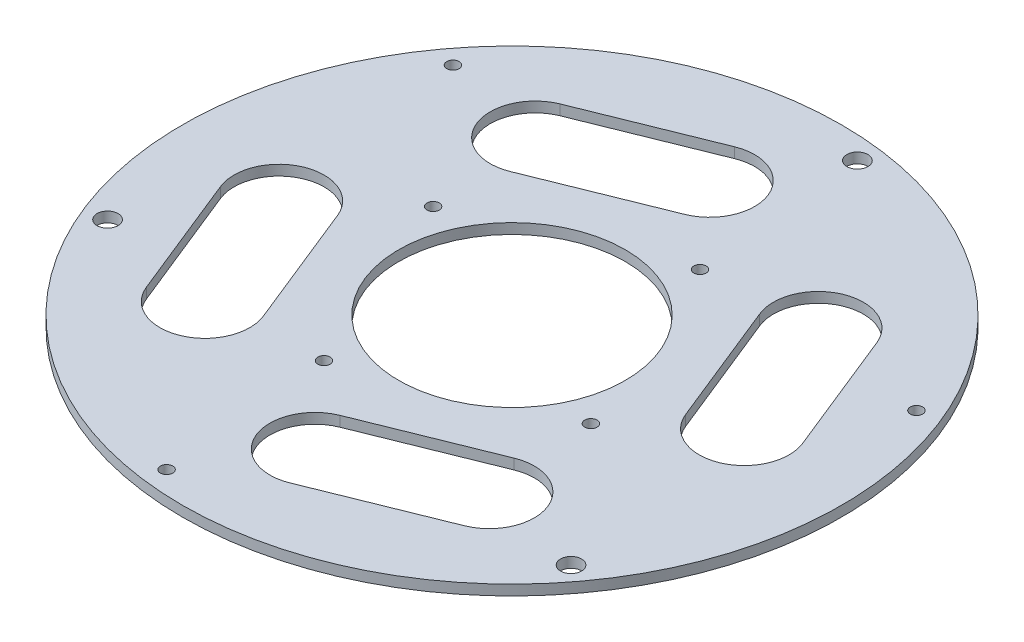
ISO-10303-21;
HEADER;
FILE_DESCRIPTION(('STEP AP214'),'2;1');
FILE_NAME('part.step','',(''),(''),'','','');
FILE_SCHEMA(('AUTOMOTIVE_DESIGN { 1 0 10303 214 1 1 1 1 }'));
ENDSEC;
DATA;
#1=APPLICATION_CONTEXT('core data for automotive mechanical design processes');
#2=APPLICATION_PROTOCOL_DEFINITION('international standard','automotive_design',2000,#1);
#3=PRODUCT_CONTEXT('',#1,'mechanical');
#4=PRODUCT('Part','Part','',(#3));
#5=PRODUCT_RELATED_PRODUCT_CATEGORY('part','',(#4));
#6=PRODUCT_DEFINITION_FORMATION('','',#4);
#7=PRODUCT_DEFINITION_CONTEXT('part definition',#1,'design');
#8=PRODUCT_DEFINITION('design','',#6,#7);
#9=PRODUCT_DEFINITION_SHAPE('','',#8);
#10=(LENGTH_UNIT() NAMED_UNIT(*) SI_UNIT(.MILLI.,.METRE.));
#11=(NAMED_UNIT(*) PLANE_ANGLE_UNIT() SI_UNIT($,.RADIAN.));
#12=(NAMED_UNIT(*) SI_UNIT($,.STERADIAN.) SOLID_ANGLE_UNIT());
#13=UNCERTAINTY_MEASURE_WITH_UNIT(LENGTH_MEASURE(1.E-05),#10,'distance_accuracy_value','');
#14=(GEOMETRIC_REPRESENTATION_CONTEXT(3) GLOBAL_UNCERTAINTY_ASSIGNED_CONTEXT((#13)) GLOBAL_UNIT_ASSIGNED_CONTEXT((#10,
#11,#12)) REPRESENTATION_CONTEXT('',''));
#15=CARTESIAN_POINT('',(0.,0.,0.));
#16=DIRECTION('',(0.,0.,1.));
#17=DIRECTION('',(1.,0.,0.));
#18=AXIS2_PLACEMENT_3D('',#15,#16,#17);
#19=CARTESIAN_POINT('',(0.,3.,0.));
#20=DIRECTION('',(0.,1.,0.));
#21=DIRECTION('',(0.,0.,1.));
#22=AXIS2_PLACEMENT_3D('',#19,#20,#21);
#23=PLANE('',#22);
#24=CARTESIAN_POINT('',(0.,3.,0.));
#25=DIRECTION('',(0.,-1.,0.));
#26=DIRECTION('',(0.,0.,-1.));
#27=AXIS2_PLACEMENT_3D('',#24,#25,#26);
#28=CIRCLE('',#27,55.);
#29=CARTESIAN_POINT('',(0.,3.,-55.));
#30=VERTEX_POINT('',#29);
#31=EDGE_CURVE('E197',#30,#30,#28,.T.);
#32=ORIENTED_EDGE('',*,*,#31,.F.);
#33=EDGE_LOOP('',(#32));
#34=FACE_BOUND('',#33,.T.);
#35=CARTESIAN_POINT('',(-26.488184691113,3.,64.7948768944698));
#36=DIRECTION('',(0.,1.,0.));
#37=DIRECTION('',(0.,0.,1.));
#38=AXIS2_PLACEMENT_3D('',#35,#36,#37);
#39=CIRCLE('',#38,3.);
#40=CARTESIAN_POINT('',(-26.488184691113,3.,67.7948768944698));
#41=VERTEX_POINT('',#40);
#42=EDGE_CURVE('E332',#41,#41,#39,.T.);
#43=ORIENTED_EDGE('',*,*,#42,.T.);
#44=EDGE_LOOP('',(#43));
#45=FACE_BOUND('',#44,.T.);
#46=CARTESIAN_POINT('',(64.7948768944695,3.,26.4881846911137));
#47=DIRECTION('',(0.,1.,0.));
#48=DIRECTION('',(0.,0.,1.));
#49=AXIS2_PLACEMENT_3D('',#46,#47,#48);
#50=CIRCLE('',#49,3.00000000000001);
#51=CARTESIAN_POINT('',(64.7948768944695,3.,29.4881846911137));
#52=VERTEX_POINT('',#51);
#53=EDGE_CURVE('E337',#52,#52,#50,.T.);
#54=ORIENTED_EDGE('',*,*,#53,.T.);
#55=EDGE_LOOP('',(#54));
#56=FACE_BOUND('',#55,.T.);
#57=CARTESIAN_POINT('',(26.4881846911135,3.,-64.7948768944696));
#58=DIRECTION('',(0.,1.,0.));
#59=DIRECTION('',(0.,0.,1.));
#60=AXIS2_PLACEMENT_3D('',#57,#58,#59);
#61=CIRCLE('',#60,3.);
#62=CARTESIAN_POINT('',(26.4881846911135,3.,-61.7948768944696));
#63=VERTEX_POINT('',#62);
#64=EDGE_CURVE('E340',#63,#63,#61,.T.);
#65=ORIENTED_EDGE('',*,*,#64,.T.);
#66=EDGE_LOOP('',(#65));
#67=FACE_BOUND('',#66,.T.);
#68=CARTESIAN_POINT('',(-64.7948768944695,3.,-26.4881846911137));
#69=DIRECTION('',(0.,1.,0.));
#70=DIRECTION('',(0.,0.,1.));
#71=AXIS2_PLACEMENT_3D('',#68,#69,#70);
#72=CIRCLE('',#71,3.);
#73=CARTESIAN_POINT('',(-64.7948768944695,3.,-23.4881846911137));
#74=VERTEX_POINT('',#73);
#75=EDGE_CURVE('E343',#74,#74,#72,.T.);
#76=ORIENTED_EDGE('',*,*,#75,.T.);
#77=EDGE_LOOP('',(#76));
#78=FACE_BOUND('',#77,.T.);
#79=CARTESIAN_POINT('',(18.8878454151755,3.,-148.806079498025));
#80=DIRECTION('',(0.,1.,0.));
#81=DIRECTION('',(0.,0.,1.));
#82=AXIS2_PLACEMENT_3D('',#79,#80,#81);
#83=CIRCLE('',#82,5.0999999999981);
#84=CARTESIAN_POINT('',(18.8878454151755,3.,-143.706079498027));
#85=VERTEX_POINT('',#84);
#86=EDGE_CURVE('E323',#85,#85,#83,.T.);
#87=ORIENTED_EDGE('',*,*,#86,.T.);
#88=EDGE_LOOP('',(#87));
#89=FACE_BOUND('',#88,.T.);
#90=CARTESIAN_POINT('',(-138.313767790444,3.,58.0456857967175));
#91=DIRECTION('',(0.,1.,0.));
#92=DIRECTION('',(0.,0.,1.));
#93=AXIS2_PLACEMENT_3D('',#90,#91,#92);
#94=CIRCLE('',#93,5.09999999999998);
#95=CARTESIAN_POINT('',(-138.313767790444,3.,63.1456857967175));
#96=VERTEX_POINT('',#95);
#97=EDGE_CURVE('E313',#96,#96,#94,.T.);
#98=ORIENTED_EDGE('',*,*,#97,.T.);
#99=EDGE_LOOP('',(#98));
#100=FACE_BOUND('',#99,.T.);
#101=CARTESIAN_POINT('',(119.425922375269,3.,90.7603937013074));
#102=DIRECTION('',(0.,1.,0.));
#103=DIRECTION('',(0.,0.,1.));
#104=AXIS2_PLACEMENT_3D('',#101,#102,#103);
#105=CIRCLE('',#104,5.09999999999913);
#106=CARTESIAN_POINT('',(119.425922375269,3.,95.8603937013066));
#107=VERTEX_POINT('',#106);
#108=EDGE_CURVE('E324',#107,#107,#105,.T.);
#109=ORIENTED_EDGE('',*,*,#108,.T.);
#110=EDGE_LOOP('',(#109));
#111=FACE_BOUND('',#110,.T.);
#112=CARTESIAN_POINT('',(68.8555329050066,3.,79.8792953417758));
#113=DIRECTION('',(0.,-1.,0.));
#114=DIRECTION('',(0.,0.,-1.));
#115=AXIS2_PLACEMENT_3D('',#112,#113,#114);
#116=CIRCLE('',#115,21.8428449653127);
#117=CARTESIAN_POINT('',(60.6285698170761,3.,59.6449939076142));
#118=VERTEX_POINT('',#117);
#119=CARTESIAN_POINT('',(77.0824959928751,3.,100.113596775963));
#120=VERTEX_POINT('',#119);
#121=EDGE_CURVE('E289',#118,#120,#116,.T.);
#122=ORIENTED_EDGE('',*,*,#121,.F.);
#123=DIRECTION('',(-0.927447708925459,0.,0.37395286763029));
#124=VECTOR('',#123,1.);
#125=CARTESIAN_POINT('',(29.1645244979781,3.,72.3314988836826));
#126=LINE('',#125,#124);
#127=CARTESIAN_POINT('',(0.344468737056292,3.,83.9519303035286));
#128=VERTEX_POINT('',#127);
#129=EDGE_CURVE('E239',#118,#128,#126,.T.);
#130=ORIENTED_EDGE('',*,*,#129,.T.);
#131=CARTESIAN_POINT('',(8.51262883790616,3.,104.209941479417));
#132=DIRECTION('',(0.,-1.,0.));
#133=DIRECTION('',(0.,0.,-1.));
#134=AXIS2_PLACEMENT_3D('',#131,#132,#133);
#135=CIRCLE('',#134,21.8427529454406);
#136=CARTESIAN_POINT('',(16.6807889387561,3.,124.467952655306));
#137=VERTEX_POINT('',#136);
#138=EDGE_CURVE('E277',#137,#128,#135,.T.);
#139=ORIENTED_EDGE('',*,*,#138,.F.);
#140=DIRECTION('',(-0.927447708925459,0.,0.37395286763029));
#141=VECTOR('',#140,1.);
#142=CARTESIAN_POINT('',(45.5008446997531,3.,112.84752123543));
#143=LINE('',#142,#141);
#144=EDGE_CURVE('E68',#120,#137,#143,.T.);
#145=ORIENTED_EDGE('',*,*,#144,.F.);
#146=EDGE_LOOP('',(#122,#130,#139,#145));
#147=FACE_BOUND('',#146,.T.);
#148=CARTESIAN_POINT('',(-104.525328062089,3.,8.57143182485349));
#149=DIRECTION('',(0.,-1.,0.));
#150=DIRECTION('',(0.,0.,-1.));
#151=AXIS2_PLACEMENT_3D('',#148,#149,#150);
#152=CIRCLE('',#151,21.8428449653128);
#153=CARTESIAN_POINT('',(-124.759629496275,3.,16.7983949127222));
#154=VERTEX_POINT('',#153);
#155=CARTESIAN_POINT('',(-84.2910266279013,3.,0.344468736985785));
#156=VERTEX_POINT('',#155);
#157=EDGE_CURVE('E230',#154,#156,#152,.T.);
#158=ORIENTED_EDGE('',*,*,#157,.F.);
#159=DIRECTION('',(0.373952867630291,0.,0.927447708925459));
#160=VECTOR('',#159,1.);
#161=CARTESIAN_POINT('',(-113.139198076402,3.,45.6184506737109));
#162=LINE('',#161,#160);
#163=CARTESIAN_POINT('',(-100.452693100307,3.,77.082495992876));
#164=VERTEX_POINT('',#163);
#165=EDGE_CURVE('E227',#154,#164,#162,.T.);
#166=ORIENTED_EDGE('',*,*,#165,.T.);
#167=CARTESIAN_POINT('',(-80.1946819244336,3.,68.9143358919871));
#168=DIRECTION('',(0.,-1.,0.));
#169=DIRECTION('',(0.,0.,-1.));
#170=AXIS2_PLACEMENT_3D('',#167,#168,#169);
#171=CIRCLE('',#170,21.8427529454408);
#172=CARTESIAN_POINT('',(-59.9366707485602,3.,60.7461757910982));
#173=VERTEX_POINT('',#172);
#174=EDGE_CURVE('E217',#173,#164,#171,.T.);
#175=ORIENTED_EDGE('',*,*,#174,.F.);
#176=DIRECTION('',(0.373952867630292,0.,0.927447708925458));
#177=VECTOR('',#176,1.);
#178=CARTESIAN_POINT('',(-72.6231757246547,3.,29.2821304719358));
#179=LINE('',#178,#177);
#180=EDGE_CURVE('E76',#156,#173,#179,.T.);
#181=ORIENTED_EDGE('',*,*,#180,.F.);
#182=EDGE_LOOP('',(#158,#166,#175,#181));
#183=FACE_BOUND('',#182,.T.);
#184=CARTESIAN_POINT('',(0.,3.,0.));
#185=DIRECTION('',(0.,-1.,0.));
#186=DIRECTION('',(0.,0.,-1.));
#187=AXIS2_PLACEMENT_3D('',#184,#185,#186);
#188=CIRCLE('',#187,160.);
#189=CARTESIAN_POINT('',(0.,3.,-160.));
#190=VERTEX_POINT('',#189);
#191=EDGE_CURVE('E311',#190,#190,#188,.T.);
#192=ORIENTED_EDGE('',*,*,#191,.T.);
#193=EDGE_LOOP('',(#192));
#194=FACE_BOUND('',#193,.T.);
#195=CARTESIAN_POINT('',(79.8792953417759,3.,-68.8555329050062));
#196=DIRECTION('',(0.,-1.,0.));
#197=DIRECTION('',(0.,0.,-1.));
#198=AXIS2_PLACEMENT_3D('',#195,#196,#197);
#199=CIRCLE('',#198,21.8428449653128);
#200=CARTESIAN_POINT('',(59.6449939075881,3.,-60.6285698171398));
#201=VERTEX_POINT('',#200);
#202=CARTESIAN_POINT('',(100.113596775964,3.,-77.0824959928726));
#203=VERTEX_POINT('',#202);
#204=EDGE_CURVE('E260',#201,#203,#199,.T.);
#205=ORIENTED_EDGE('',*,*,#204,.F.);
#206=DIRECTION('',(0.373952867630291,0.,0.927447708925458));
#207=VECTOR('',#206,1.);
#208=CARTESIAN_POINT('',(72.3314988836823,3.,-29.1645244979781));
#209=LINE('',#208,#207);
#210=CARTESIAN_POINT('',(83.951930303557,3.,-0.344468736984967));
#211=VERTEX_POINT('',#210);
#212=EDGE_CURVE('E209',#201,#211,#209,.T.);
#213=ORIENTED_EDGE('',*,*,#212,.T.);
#214=CARTESIAN_POINT('',(104.209941479431,3.,-8.51262883787253));
#215=DIRECTION('',(0.,-1.,0.));
#216=DIRECTION('',(0.,0.,-1.));
#217=AXIS2_PLACEMENT_3D('',#214,#215,#216);
#218=CIRCLE('',#217,21.8427529454408);
#219=CARTESIAN_POINT('',(124.467952655305,3.,-16.6807889387601));
#220=VERTEX_POINT('',#219);
#221=EDGE_CURVE('E248',#220,#211,#218,.T.);
#222=ORIENTED_EDGE('',*,*,#221,.F.);
#223=DIRECTION('',(0.373952867630291,0.,0.927447708925458));
#224=VECTOR('',#223,1.);
#225=CARTESIAN_POINT('',(112.84752123543,3.,-45.5008446997532));
#226=LINE('',#225,#224);
#227=EDGE_CURVE('E263',#203,#220,#226,.T.);
#228=ORIENTED_EDGE('',*,*,#227,.F.);
#229=EDGE_LOOP('',(#205,#213,#222,#228));
#230=FACE_BOUND('',#229,.T.);
#231=DIRECTION('',(-0.927447708925459,0.,0.373952867630289));
#232=VECTOR('',#231,1.);
#233=CARTESIAN_POINT('',(-29.2821304719356,3.,-72.6231757246548));
#234=LINE('',#233,#232);
#235=CARTESIAN_POINT('',(-0.344468736986014,3.,-84.2910266279011));
#236=VERTEX_POINT('',#235);
#237=CARTESIAN_POINT('',(-60.7461757911009,3.,-59.9366707485593));
#238=VERTEX_POINT('',#237);
#239=EDGE_CURVE('E173',#236,#238,#234,.T.);
#240=ORIENTED_EDGE('',*,*,#239,.F.);
#241=CARTESIAN_POINT('',(-8.57143182485231,3.,-104.525328062089));
#242=DIRECTION('',(0.,-1.,0.));
#243=DIRECTION('',(0.,0.,-1.));
#244=AXIS2_PLACEMENT_3D('',#241,#242,#243);
#245=CIRCLE('',#244,21.8428449653127);
#246=CARTESIAN_POINT('',(-16.7983949127351,3.,-124.75962949627));
#247=VERTEX_POINT('',#246);
#248=EDGE_CURVE('E191',#247,#236,#245,.T.);
#249=ORIENTED_EDGE('',*,*,#248,.F.);
#250=DIRECTION('',(-0.927447708925459,0.,0.373952867630289));
#251=VECTOR('',#250,1.);
#252=CARTESIAN_POINT('',(-45.6184506737106,3.,-113.139198076402));
#253=LINE('',#252,#251);
#254=CARTESIAN_POINT('',(-77.0824959928838,3.,-100.452693100304));
#255=VERTEX_POINT('',#254);
#256=EDGE_CURVE('E194',#247,#255,#253,.T.);
#257=ORIENTED_EDGE('',*,*,#256,.T.);
#258=CARTESIAN_POINT('',(-68.9143358919913,3.,-80.194681924432));
#259=DIRECTION('',(0.,-1.,0.));
#260=DIRECTION('',(0.,0.,-1.));
#261=AXIS2_PLACEMENT_3D('',#258,#259,#260);
#262=CIRCLE('',#261,21.8427529454407);
#263=EDGE_CURVE('E203',#238,#255,#262,.T.);
#264=ORIENTED_EDGE('',*,*,#263,.F.);
#265=EDGE_LOOP('',(#240,#249,#257,#264));
#266=FACE_BOUND('',#265,.T.);
#267=CARTESIAN_POINT('',(-119.425922375269,3.,-90.7603937013075));
#268=DIRECTION('',(0.,1.,0.));
#269=DIRECTION('',(0.,0.,1.));
#270=AXIS2_PLACEMENT_3D('',#267,#268,#269);
#271=CIRCLE('',#270,3.00000000000001);
#272=CARTESIAN_POINT('',(-119.425922375269,3.,-87.7603937013075));
#273=VERTEX_POINT('',#272);
#274=EDGE_CURVE('E351',#273,#273,#271,.T.);
#275=ORIENTED_EDGE('',*,*,#274,.T.);
#276=EDGE_LOOP('',(#275));
#277=FACE_BOUND('',#276,.T.);
#278=CARTESIAN_POINT('',(138.313767790444,3.,-58.0456857967166));
#279=DIRECTION('',(0.,1.,0.));
#280=DIRECTION('',(0.,0.,1.));
#281=AXIS2_PLACEMENT_3D('',#278,#279,#280);
#282=CIRCLE('',#281,2.99999999999999);
#283=CARTESIAN_POINT('',(138.313767790444,3.,-55.0456857967166));
#284=VERTEX_POINT('',#283);
#285=EDGE_CURVE('E362',#284,#284,#282,.T.);
#286=ORIENTED_EDGE('',*,*,#285,.T.);
#287=EDGE_LOOP('',(#286));
#288=FACE_BOUND('',#287,.T.);
#289=CARTESIAN_POINT('',(-18.8878454151745,3.,148.806079498025));
#290=DIRECTION('',(0.,1.,0.));
#291=DIRECTION('',(0.,0.,1.));
#292=AXIS2_PLACEMENT_3D('',#289,#290,#291);
#293=CIRCLE('',#292,3.);
#294=CARTESIAN_POINT('',(-18.8878454151745,3.,151.806079498025));
#295=VERTEX_POINT('',#294);
#296=EDGE_CURVE('E368',#295,#295,#293,.T.);
#297=ORIENTED_EDGE('',*,*,#296,.T.);
#298=EDGE_LOOP('',(#297));
#299=FACE_BOUND('',#298,.T.);
#300=ADVANCED_FACE('F53',(#34,#45,#56,#67,#78,#89,#100,#111,#147,#183,#194,#230,#266,#277,#288,
#299),#23,.F.);
#301=CARTESIAN_POINT('',(0.,3.,0.));
#302=DIRECTION('',(0.,-1.,0.));
#303=DIRECTION('',(0.,0.,-1.));
#304=AXIS2_PLACEMENT_3D('',#301,#302,#303);
#305=CYLINDRICAL_SURFACE('',#304,160.);
#306=CARTESIAN_POINT('',(0.,8.,0.));
#307=DIRECTION('',(0.,1.,0.));
#308=DIRECTION('',(0.,0.,1.));
#309=AXIS2_PLACEMENT_3D('',#306,#307,#308);
#310=CIRCLE('',#309,160.);
#311=CARTESIAN_POINT('',(0.,8.,160.));
#312=VERTEX_POINT('',#311);
#313=EDGE_CURVE('E12',#312,#312,#310,.T.);
#314=ORIENTED_EDGE('',*,*,#313,.F.);
#315=EDGE_LOOP('',(#314));
#316=FACE_BOUND('',#315,.T.);
#317=ORIENTED_EDGE('',*,*,#191,.F.);
#318=EDGE_LOOP('',(#317));
#319=FACE_BOUND('',#318,.T.);
#320=ADVANCED_FACE('F55',(#316,#319),#305,.T.);
#321=CARTESIAN_POINT('',(0.,3.,0.));
#322=DIRECTION('',(0.,-1.,0.));
#323=DIRECTION('',(0.,0.,-1.));
#324=AXIS2_PLACEMENT_3D('',#321,#322,#323);
#325=CYLINDRICAL_SURFACE('',#324,55.);
#326=CARTESIAN_POINT('',(0.,8.,0.));
#327=DIRECTION('',(0.,-1.,0.));
#328=DIRECTION('',(0.,0.,-1.));
#329=AXIS2_PLACEMENT_3D('',#326,#327,#328);
#330=CIRCLE('',#329,55.);
#331=CARTESIAN_POINT('',(0.,8.,-55.));
#332=VERTEX_POINT('',#331);
#333=EDGE_CURVE('E61',#332,#332,#330,.T.);
#334=ORIENTED_EDGE('',*,*,#333,.F.);
#335=EDGE_LOOP('',(#334));
#336=FACE_BOUND('',#335,.T.);
#337=ORIENTED_EDGE('',*,*,#31,.T.);
#338=EDGE_LOOP('',(#337));
#339=FACE_BOUND('',#338,.T.);
#340=ADVANCED_FACE('F305',(#336,#339),#325,.F.);
#341=CARTESIAN_POINT('',(0.,8.,0.));
#342=DIRECTION('',(0.,1.,0.));
#343=DIRECTION('',(0.,0.,1.));
#344=AXIS2_PLACEMENT_3D('',#341,#342,#343);
#345=PLANE('',#344);
#346=CARTESIAN_POINT('',(-26.488184691113,8.,64.7948768944698));
#347=DIRECTION('',(0.,1.,0.));
#348=DIRECTION('',(0.,0.,1.));
#349=AXIS2_PLACEMENT_3D('',#346,#347,#348);
#350=CIRCLE('',#349,3.);
#351=CARTESIAN_POINT('',(-26.488184691113,8.,67.7948768944698));
#352=VERTEX_POINT('',#351);
#353=EDGE_CURVE('E346',#352,#352,#350,.T.);
#354=ORIENTED_EDGE('',*,*,#353,.F.);
#355=EDGE_LOOP('',(#354));
#356=FACE_BOUND('',#355,.T.);
#357=CARTESIAN_POINT('',(64.7948768944695,8.,26.4881846911137));
#358=DIRECTION('',(0.,1.,0.));
#359=DIRECTION('',(0.,0.,1.));
#360=AXIS2_PLACEMENT_3D('',#357,#358,#359);
#361=CIRCLE('',#360,3.00000000000001);
#362=CARTESIAN_POINT('',(64.7948768944695,8.,29.4881846911137));
#363=VERTEX_POINT('',#362);
#364=EDGE_CURVE('E354',#363,#363,#361,.T.);
#365=ORIENTED_EDGE('',*,*,#364,.F.);
#366=EDGE_LOOP('',(#365));
#367=FACE_BOUND('',#366,.T.);
#368=CARTESIAN_POINT('',(26.4881846911135,8.,-64.7948768944696));
#369=DIRECTION('',(0.,1.,0.));
#370=DIRECTION('',(0.,0.,1.));
#371=AXIS2_PLACEMENT_3D('',#368,#369,#370);
#372=CIRCLE('',#371,3.);
#373=CARTESIAN_POINT('',(26.4881846911135,8.,-61.7948768944696));
#374=VERTEX_POINT('',#373);
#375=EDGE_CURVE('E350',#374,#374,#372,.T.);
#376=ORIENTED_EDGE('',*,*,#375,.F.);
#377=EDGE_LOOP('',(#376));
#378=FACE_BOUND('',#377,.T.);
#379=CARTESIAN_POINT('',(-64.7948768944695,8.,-26.4881846911137));
#380=DIRECTION('',(0.,1.,0.));
#381=DIRECTION('',(0.,0.,1.));
#382=AXIS2_PLACEMENT_3D('',#379,#380,#381);
#383=CIRCLE('',#382,3.);
#384=CARTESIAN_POINT('',(-64.7948768944695,8.,-23.4881846911137));
#385=VERTEX_POINT('',#384);
#386=EDGE_CURVE('E347',#385,#385,#383,.T.);
#387=ORIENTED_EDGE('',*,*,#386,.F.);
#388=EDGE_LOOP('',(#387));
#389=FACE_BOUND('',#388,.T.);
#390=CARTESIAN_POINT('',(18.8878454151755,8.,-148.806079498025));
#391=DIRECTION('',(0.,1.,0.));
#392=DIRECTION('',(0.,0.,1.));
#393=AXIS2_PLACEMENT_3D('',#390,#391,#392);
#394=CIRCLE('',#393,5.0999999999981);
#395=CARTESIAN_POINT('',(18.8878454151755,8.,-143.706079498027));
#396=VERTEX_POINT('',#395);
#397=EDGE_CURVE('E320',#396,#396,#394,.T.);
#398=ORIENTED_EDGE('',*,*,#397,.F.);
#399=EDGE_LOOP('',(#398));
#400=FACE_BOUND('',#399,.T.);
#401=CARTESIAN_POINT('',(-138.313767790444,8.,58.0456857967175));
#402=DIRECTION('',(0.,1.,0.));
#403=DIRECTION('',(0.,0.,1.));
#404=AXIS2_PLACEMENT_3D('',#401,#402,#403);
#405=CIRCLE('',#404,5.09999999999998);
#406=CARTESIAN_POINT('',(-138.313767790444,8.,63.1456857967175));
#407=VERTEX_POINT('',#406);
#408=EDGE_CURVE('E317',#407,#407,#405,.T.);
#409=ORIENTED_EDGE('',*,*,#408,.F.);
#410=EDGE_LOOP('',(#409));
#411=FACE_BOUND('',#410,.T.);
#412=CARTESIAN_POINT('',(119.425922375269,8.,90.7603937013074));
#413=DIRECTION('',(0.,1.,0.));
#414=DIRECTION('',(0.,0.,1.));
#415=AXIS2_PLACEMENT_3D('',#412,#413,#414);
#416=CIRCLE('',#415,5.09999999999913);
#417=CARTESIAN_POINT('',(119.425922375269,8.,95.8603937013066));
#418=VERTEX_POINT('',#417);
#419=EDGE_CURVE('E329',#418,#418,#416,.T.);
#420=ORIENTED_EDGE('',*,*,#419,.F.);
#421=EDGE_LOOP('',(#420));
#422=FACE_BOUND('',#421,.T.);
#423=DIRECTION('',(-0.927447708925459,0.,0.373952867630289));
#424=VECTOR('',#423,1.);
#425=CARTESIAN_POINT('',(-29.2821304719356,8.,-72.6231757246548));
#426=LINE('',#425,#424);
#427=CARTESIAN_POINT('',(-0.344468736986014,8.,-84.2910266279011));
#428=VERTEX_POINT('',#427);
#429=CARTESIAN_POINT('',(-60.7461757911009,8.,-59.9366707485593));
#430=VERTEX_POINT('',#429);
#431=EDGE_CURVE('E170',#428,#430,#426,.T.);
#432=ORIENTED_EDGE('',*,*,#431,.T.);
#433=CARTESIAN_POINT('',(-68.9143358919913,8.,-80.194681924432));
#434=DIRECTION('',(0.,-1.,0.));
#435=DIRECTION('',(0.,0.,-1.));
#436=AXIS2_PLACEMENT_3D('',#433,#434,#435);
#437=CIRCLE('',#436,21.8427529454407);
#438=CARTESIAN_POINT('',(-77.0824959928838,8.,-100.452693100304));
#439=VERTEX_POINT('',#438);
#440=EDGE_CURVE('E181',#430,#439,#437,.T.);
#441=ORIENTED_EDGE('',*,*,#440,.T.);
#442=DIRECTION('',(-0.927447708925459,0.,0.373952867630289));
#443=VECTOR('',#442,1.);
#444=CARTESIAN_POINT('',(-45.6184506737106,8.,-113.139198076402));
#445=LINE('',#444,#443);
#446=CARTESIAN_POINT('',(-16.7983949127351,8.,-124.75962949627));
#447=VERTEX_POINT('',#446);
#448=EDGE_CURVE('E186',#447,#439,#445,.T.);
#449=ORIENTED_EDGE('',*,*,#448,.F.);
#450=CARTESIAN_POINT('',(-8.57143182485231,8.,-104.525328062089));
#451=DIRECTION('',(0.,-1.,0.));
#452=DIRECTION('',(0.,0.,-1.));
#453=AXIS2_PLACEMENT_3D('',#450,#451,#452);
#454=CIRCLE('',#453,21.8428449653127);
#455=EDGE_CURVE('E178',#447,#428,#454,.T.);
#456=ORIENTED_EDGE('',*,*,#455,.T.);
#457=EDGE_LOOP('',(#432,#441,#449,#456));
#458=FACE_BOUND('',#457,.T.);
#459=ORIENTED_EDGE('',*,*,#333,.T.);
#460=EDGE_LOOP('',(#459));
#461=FACE_BOUND('',#460,.T.);
#462=ORIENTED_EDGE('',*,*,#313,.T.);
#463=EDGE_LOOP('',(#462));
#464=FACE_BOUND('',#463,.T.);
#465=CARTESIAN_POINT('',(8.51262883790616,8.,104.209941479417));
#466=DIRECTION('',(0.,-1.,0.));
#467=DIRECTION('',(0.,0.,-1.));
#468=AXIS2_PLACEMENT_3D('',#465,#466,#467);
#469=CIRCLE('',#468,21.8427529454406);
#470=CARTESIAN_POINT('',(16.6807889387561,8.,124.467952655306));
#471=VERTEX_POINT('',#470);
#472=CARTESIAN_POINT('',(0.344468737056292,8.,83.9519303035286));
#473=VERTEX_POINT('',#472);
#474=EDGE_CURVE('E283',#471,#473,#469,.T.);
#475=ORIENTED_EDGE('',*,*,#474,.T.);
#476=DIRECTION('',(-0.927447708925459,0.,0.37395286763029));
#477=VECTOR('',#476,1.);
#478=CARTESIAN_POINT('',(29.1645244979781,8.,72.3314988836826));
#479=LINE('',#478,#477);
#480=CARTESIAN_POINT('',(60.6285698170761,8.,59.6449939076142));
#481=VERTEX_POINT('',#480);
#482=EDGE_CURVE('E274',#481,#473,#479,.T.);
#483=ORIENTED_EDGE('',*,*,#482,.F.);
#484=CARTESIAN_POINT('',(68.8555329050066,8.,79.8792953417758));
#485=DIRECTION('',(0.,-1.,0.));
#486=DIRECTION('',(0.,0.,-1.));
#487=AXIS2_PLACEMENT_3D('',#484,#485,#486);
#488=CIRCLE('',#487,21.8428449653127);
#489=CARTESIAN_POINT('',(77.0824959928751,8.,100.113596775963));
#490=VERTEX_POINT('',#489);
#491=EDGE_CURVE('E276',#481,#490,#488,.T.);
#492=ORIENTED_EDGE('',*,*,#491,.T.);
#493=DIRECTION('',(-0.927447708925459,0.,0.37395286763029));
#494=VECTOR('',#493,1.);
#495=CARTESIAN_POINT('',(45.5008446997531,8.,112.84752123543));
#496=LINE('',#495,#494);
#497=EDGE_CURVE('E280',#490,#471,#496,.T.);
#498=ORIENTED_EDGE('',*,*,#497,.T.);
#499=EDGE_LOOP('',(#475,#483,#492,#498));
#500=FACE_BOUND('',#499,.T.);
#501=CARTESIAN_POINT('',(104.209941479431,8.,-8.51262883787253));
#502=DIRECTION('',(0.,-1.,0.));
#503=DIRECTION('',(0.,0.,-1.));
#504=AXIS2_PLACEMENT_3D('',#501,#502,#503);
#505=CIRCLE('',#504,21.8427529454408);
#506=CARTESIAN_POINT('',(124.467952655305,8.,-16.6807889387601));
#507=VERTEX_POINT('',#506);
#508=CARTESIAN_POINT('',(83.951930303557,8.,-0.344468736984967));
#509=VERTEX_POINT('',#508);
#510=EDGE_CURVE('E254',#507,#509,#505,.T.);
#511=ORIENTED_EDGE('',*,*,#510,.T.);
#512=DIRECTION('',(0.373952867630291,0.,0.927447708925458));
#513=VECTOR('',#512,1.);
#514=CARTESIAN_POINT('',(72.3314988836823,8.,-29.1645244979781));
#515=LINE('',#514,#513);
#516=CARTESIAN_POINT('',(59.6449939075881,8.,-60.6285698171398));
#517=VERTEX_POINT('',#516);
#518=EDGE_CURVE('E245',#517,#509,#515,.T.);
#519=ORIENTED_EDGE('',*,*,#518,.F.);
#520=CARTESIAN_POINT('',(79.8792953417759,8.,-68.8555329050062));
#521=DIRECTION('',(0.,-1.,0.));
#522=DIRECTION('',(0.,0.,-1.));
#523=AXIS2_PLACEMENT_3D('',#520,#521,#522);
#524=CIRCLE('',#523,21.8428449653128);
#525=CARTESIAN_POINT('',(100.113596775964,8.,-77.0824959928726));
#526=VERTEX_POINT('',#525);
#527=EDGE_CURVE('E247',#517,#526,#524,.T.);
#528=ORIENTED_EDGE('',*,*,#527,.T.);
#529=DIRECTION('',(0.373952867630291,0.,0.927447708925458));
#530=VECTOR('',#529,1.);
#531=CARTESIAN_POINT('',(112.84752123543,8.,-45.5008446997532));
#532=LINE('',#531,#530);
#533=EDGE_CURVE('E251',#526,#507,#532,.T.);
#534=ORIENTED_EDGE('',*,*,#533,.T.);
#535=EDGE_LOOP('',(#511,#519,#528,#534));
#536=FACE_BOUND('',#535,.T.);
#537=CARTESIAN_POINT('',(-80.1946819244336,8.,68.9143358919871));
#538=DIRECTION('',(0.,-1.,0.));
#539=DIRECTION('',(0.,0.,-1.));
#540=AXIS2_PLACEMENT_3D('',#537,#538,#539);
#541=CIRCLE('',#540,21.8427529454408);
#542=CARTESIAN_POINT('',(-59.9366707485602,8.,60.7461757910982));
#543=VERTEX_POINT('',#542);
#544=CARTESIAN_POINT('',(-100.452693100307,8.,77.082495992876));
#545=VERTEX_POINT('',#544);
#546=EDGE_CURVE('E223',#543,#545,#541,.T.);
#547=ORIENTED_EDGE('',*,*,#546,.T.);
#548=DIRECTION('',(0.373952867630291,0.,0.927447708925459));
#549=VECTOR('',#548,1.);
#550=CARTESIAN_POINT('',(-113.139198076402,8.,45.6184506737109));
#551=LINE('',#550,#549);
#552=CARTESIAN_POINT('',(-124.759629496275,8.,16.7983949127222));
#553=VERTEX_POINT('',#552);
#554=EDGE_CURVE('E214',#553,#545,#551,.T.);
#555=ORIENTED_EDGE('',*,*,#554,.F.);
#556=CARTESIAN_POINT('',(-104.525328062089,8.,8.57143182485349));
#557=DIRECTION('',(0.,-1.,0.));
#558=DIRECTION('',(0.,0.,-1.));
#559=AXIS2_PLACEMENT_3D('',#556,#557,#558);
#560=CIRCLE('',#559,21.8428449653128);
#561=CARTESIAN_POINT('',(-84.2910266279013,8.,0.344468736985782));
#562=VERTEX_POINT('',#561);
#563=EDGE_CURVE('E216',#553,#562,#560,.T.);
#564=ORIENTED_EDGE('',*,*,#563,.T.);
#565=DIRECTION('',(0.373952867630292,0.,0.927447708925458));
#566=VECTOR('',#565,1.);
#567=CARTESIAN_POINT('',(-72.6231757246547,8.,29.2821304719358));
#568=LINE('',#567,#566);
#569=EDGE_CURVE('E220',#562,#543,#568,.T.);
#570=ORIENTED_EDGE('',*,*,#569,.T.);
#571=EDGE_LOOP('',(#547,#555,#564,#570));
#572=FACE_BOUND('',#571,.T.);
#573=CARTESIAN_POINT('',(-119.425922375269,8.,-90.7603937013075));
#574=DIRECTION('',(0.,1.,0.));
#575=DIRECTION('',(0.,0.,1.));
#576=AXIS2_PLACEMENT_3D('',#573,#574,#575);
#577=CIRCLE('',#576,3.00000000000001);
#578=CARTESIAN_POINT('',(-119.425922375269,8.,-87.7603937013075));
#579=VERTEX_POINT('',#578);
#580=EDGE_CURVE('E359',#579,#579,#577,.T.);
#581=ORIENTED_EDGE('',*,*,#580,.F.);
#582=EDGE_LOOP('',(#581));
#583=FACE_BOUND('',#582,.T.);
#584=CARTESIAN_POINT('',(138.313767790444,8.,-58.0456857967166));
#585=DIRECTION('',(0.,1.,0.));
#586=DIRECTION('',(0.,0.,1.));
#587=AXIS2_PLACEMENT_3D('',#584,#585,#586);
#588=CIRCLE('',#587,2.99999999999999);
#589=CARTESIAN_POINT('',(138.313767790444,8.,-55.0456857967166));
#590=VERTEX_POINT('',#589);
#591=EDGE_CURVE('E365',#590,#590,#588,.T.);
#592=ORIENTED_EDGE('',*,*,#591,.F.);
#593=EDGE_LOOP('',(#592));
#594=FACE_BOUND('',#593,.T.);
#595=CARTESIAN_POINT('',(-18.8878454151745,8.,148.806079498025));
#596=DIRECTION('',(0.,1.,0.));
#597=DIRECTION('',(0.,0.,1.));
#598=AXIS2_PLACEMENT_3D('',#595,#596,#597);
#599=CIRCLE('',#598,3.);
#600=CARTESIAN_POINT('',(-18.8878454151745,8.,151.806079498025));
#601=VERTEX_POINT('',#600);
#602=EDGE_CURVE('E371',#601,#601,#599,.T.);
#603=ORIENTED_EDGE('',*,*,#602,.F.);
#604=EDGE_LOOP('',(#603));
#605=FACE_BOUND('',#604,.T.);
#606=ADVANCED_FACE('F188',(#356,#367,#378,#389,#400,#411,#422,#458,#461,#464,#500,#536,#572,
#583,#594,#605),#345,.T.);
#607=CARTESIAN_POINT('',(29.1645244979781,8.,72.3314988836826));
#608=DIRECTION('',(0.37395286763029,0.,0.927447708925459));
#609=DIRECTION('',(0.927447708925459,0.,-0.37395286763029));
#610=AXIS2_PLACEMENT_3D('',#607,#608,#609);
#611=PLANE('',#610);
#612=ORIENTED_EDGE('',*,*,#129,.F.);
#613=DIRECTION('',(0.,-1.,0.));
#614=VECTOR('',#613,1.);
#615=CARTESIAN_POINT('',(60.6285698170761,8.,59.6449939076142));
#616=LINE('',#615,#614);
#617=EDGE_CURVE('E286',#481,#118,#616,.T.);
#618=ORIENTED_EDGE('',*,*,#617,.F.);
#619=ORIENTED_EDGE('',*,*,#482,.T.);
#620=DIRECTION('',(0.,-1.,0.));
#621=VECTOR('',#620,1.);
#622=CARTESIAN_POINT('',(0.344468737056292,8.,83.9519303035286));
#623=LINE('',#622,#621);
#624=EDGE_CURVE('E295',#473,#128,#623,.T.);
#625=ORIENTED_EDGE('',*,*,#624,.T.);
#626=EDGE_LOOP('',(#612,#618,#619,#625));
#627=FACE_BOUND('',#626,.T.);
#628=ADVANCED_FACE('F386',(#627),#611,.T.);
#629=CARTESIAN_POINT('',(8.51262883790616,8.,104.209941479417));
#630=DIRECTION('',(0.,-1.,0.));
#631=DIRECTION('',(0.,0.,-1.));
#632=AXIS2_PLACEMENT_3D('',#629,#630,#631);
#633=CYLINDRICAL_SURFACE('',#632,21.8427529454406);
#634=ORIENTED_EDGE('',*,*,#138,.T.);
#635=ORIENTED_EDGE('',*,*,#624,.F.);
#636=ORIENTED_EDGE('',*,*,#474,.F.);
#637=DIRECTION('',(0.,-1.,0.));
#638=VECTOR('',#637,1.);
#639=CARTESIAN_POINT('',(16.6807889387561,8.,124.467952655306));
#640=LINE('',#639,#638);
#641=EDGE_CURVE('E297',#471,#137,#640,.T.);
#642=ORIENTED_EDGE('',*,*,#641,.T.);
#643=EDGE_LOOP('',(#634,#635,#636,#642));
#644=FACE_BOUND('',#643,.T.);
#645=ADVANCED_FACE('F392',(#644),#633,.F.);
#646=CARTESIAN_POINT('',(45.5008446997531,8.,112.84752123543));
#647=DIRECTION('',(0.37395286763029,0.,0.927447708925459));
#648=DIRECTION('',(0.927447708925459,0.,-0.37395286763029));
#649=AXIS2_PLACEMENT_3D('',#646,#647,#648);
#650=PLANE('',#649);
#651=ORIENTED_EDGE('',*,*,#144,.T.);
#652=ORIENTED_EDGE('',*,*,#641,.F.);
#653=ORIENTED_EDGE('',*,*,#497,.F.);
#654=DIRECTION('',(0.,-1.,0.));
#655=VECTOR('',#654,1.);
#656=CARTESIAN_POINT('',(77.0824959928751,8.,100.113596775963));
#657=LINE('',#656,#655);
#658=EDGE_CURVE('E299',#490,#120,#657,.T.);
#659=ORIENTED_EDGE('',*,*,#658,.T.);
#660=EDGE_LOOP('',(#651,#652,#653,#659));
#661=FACE_BOUND('',#660,.T.);
#662=ADVANCED_FACE('F517',(#661),#650,.F.);
#663=CARTESIAN_POINT('',(68.8555329050066,8.,79.8792953417758));
#664=DIRECTION('',(0.,-1.,0.));
#665=DIRECTION('',(0.,0.,-1.));
#666=AXIS2_PLACEMENT_3D('',#663,#664,#665);
#667=CYLINDRICAL_SURFACE('',#666,21.8428449653127);
#668=ORIENTED_EDGE('',*,*,#121,.T.);
#669=ORIENTED_EDGE('',*,*,#658,.F.);
#670=ORIENTED_EDGE('',*,*,#491,.F.);
#671=ORIENTED_EDGE('',*,*,#617,.T.);
#672=EDGE_LOOP('',(#668,#669,#670,#671));
#673=FACE_BOUND('',#672,.T.);
#674=ADVANCED_FACE('F485',(#673),#667,.F.);
#675=CARTESIAN_POINT('',(-29.2821304719356,8.,-72.6231757246548));
#676=DIRECTION('',(0.373952867630289,0.,0.927447708925459));
#677=DIRECTION('',(0.927447708925459,0.,-0.373952867630289));
#678=AXIS2_PLACEMENT_3D('',#675,#676,#677);
#679=PLANE('',#678);
#680=ORIENTED_EDGE('',*,*,#239,.T.);
#681=DIRECTION('',(0.,-1.,0.));
#682=VECTOR('',#681,1.);
#683=CARTESIAN_POINT('',(-60.7461757911009,8.,-59.9366707485593));
#684=LINE('',#683,#682);
#685=EDGE_CURVE('E166',#430,#238,#684,.T.);
#686=ORIENTED_EDGE('',*,*,#685,.F.);
#687=ORIENTED_EDGE('',*,*,#431,.F.);
#688=DIRECTION('',(0.,-1.,0.));
#689=VECTOR('',#688,1.);
#690=CARTESIAN_POINT('',(-0.344468736986014,8.,-84.2910266279011));
#691=LINE('',#690,#689);
#692=EDGE_CURVE('E207',#428,#236,#691,.T.);
#693=ORIENTED_EDGE('',*,*,#692,.T.);
#694=EDGE_LOOP('',(#680,#686,#687,#693));
#695=FACE_BOUND('',#694,.T.);
#696=ADVANCED_FACE('F168',(#695),#679,.F.);
#697=CARTESIAN_POINT('',(-8.57143182485231,8.,-104.525328062089));
#698=DIRECTION('',(0.,-1.,0.));
#699=DIRECTION('',(0.,0.,-1.));
#700=AXIS2_PLACEMENT_3D('',#697,#698,#699);
#701=CYLINDRICAL_SURFACE('',#700,21.8428449653127);
#702=ORIENTED_EDGE('',*,*,#248,.T.);
#703=ORIENTED_EDGE('',*,*,#692,.F.);
#704=ORIENTED_EDGE('',*,*,#455,.F.);
#705=DIRECTION('',(0.,-1.,0.));
#706=VECTOR('',#705,1.);
#707=CARTESIAN_POINT('',(-16.7983949127351,8.,-124.75962949627));
#708=LINE('',#707,#706);
#709=EDGE_CURVE('E210',#447,#247,#708,.T.);
#710=ORIENTED_EDGE('',*,*,#709,.T.);
#711=EDGE_LOOP('',(#702,#703,#704,#710));
#712=FACE_BOUND('',#711,.T.);
#713=ADVANCED_FACE('F472',(#712),#701,.F.);
#714=CARTESIAN_POINT('',(-45.6184506737106,8.,-113.139198076402));
#715=DIRECTION('',(0.373952867630289,0.,0.927447708925459));
#716=DIRECTION('',(0.927447708925459,0.,-0.373952867630289));
#717=AXIS2_PLACEMENT_3D('',#714,#715,#716);
#718=PLANE('',#717);
#719=ORIENTED_EDGE('',*,*,#256,.F.);
#720=ORIENTED_EDGE('',*,*,#709,.F.);
#721=ORIENTED_EDGE('',*,*,#448,.T.);
#722=DIRECTION('',(0.,-1.,0.));
#723=VECTOR('',#722,1.);
#724=CARTESIAN_POINT('',(-77.0824959928838,8.,-100.452693100304));
#725=LINE('',#724,#723);
#726=EDGE_CURVE('E177',#439,#255,#725,.T.);
#727=ORIENTED_EDGE('',*,*,#726,.T.);
#728=EDGE_LOOP('',(#719,#720,#721,#727));
#729=FACE_BOUND('',#728,.T.);
#730=ADVANCED_FACE('F475',(#729),#718,.T.);
#731=CARTESIAN_POINT('',(-68.9143358919913,8.,-80.194681924432));
#732=DIRECTION('',(0.,-1.,0.));
#733=DIRECTION('',(0.,0.,-1.));
#734=AXIS2_PLACEMENT_3D('',#731,#732,#733);
#735=CYLINDRICAL_SURFACE('',#734,21.8427529454407);
#736=ORIENTED_EDGE('',*,*,#263,.T.);
#737=ORIENTED_EDGE('',*,*,#726,.F.);
#738=ORIENTED_EDGE('',*,*,#440,.F.);
#739=ORIENTED_EDGE('',*,*,#685,.T.);
#740=EDGE_LOOP('',(#736,#737,#738,#739));
#741=FACE_BOUND('',#740,.T.);
#742=ADVANCED_FACE('F182',(#741),#735,.F.);
#743=CARTESIAN_POINT('',(72.3314988836823,8.,-29.1645244979781));
#744=DIRECTION('',(0.927447708925458,0.,-0.373952867630291));
#745=DIRECTION('',(-0.373952867630291,0.,-0.927447708925458));
#746=AXIS2_PLACEMENT_3D('',#743,#744,#745);
#747=PLANE('',#746);
#748=ORIENTED_EDGE('',*,*,#212,.F.);
#749=DIRECTION('',(0.,-1.,0.));
#750=VECTOR('',#749,1.);
#751=CARTESIAN_POINT('',(59.6449939075881,8.,-60.6285698171398));
#752=LINE('',#751,#750);
#753=EDGE_CURVE('E257',#517,#201,#752,.T.);
#754=ORIENTED_EDGE('',*,*,#753,.F.);
#755=ORIENTED_EDGE('',*,*,#518,.T.);
#756=DIRECTION('',(0.,-1.,0.));
#757=VECTOR('',#756,1.);
#758=CARTESIAN_POINT('',(83.951930303557,8.,-0.344468736984967));
#759=LINE('',#758,#757);
#760=EDGE_CURVE('E231',#509,#211,#759,.T.);
#761=ORIENTED_EDGE('',*,*,#760,.T.);
#762=EDGE_LOOP('',(#748,#754,#755,#761));
#763=FACE_BOUND('',#762,.T.);
#764=ADVANCED_FACE('F482',(#763),#747,.T.);
#765=CARTESIAN_POINT('',(104.209941479431,8.,-8.51262883787253));
#766=DIRECTION('',(0.,-1.,0.));
#767=DIRECTION('',(0.,0.,-1.));
#768=AXIS2_PLACEMENT_3D('',#765,#766,#767);
#769=CYLINDRICAL_SURFACE('',#768,21.8427529454408);
#770=ORIENTED_EDGE('',*,*,#221,.T.);
#771=ORIENTED_EDGE('',*,*,#760,.F.);
#772=ORIENTED_EDGE('',*,*,#510,.F.);
#773=DIRECTION('',(0.,-1.,0.));
#774=VECTOR('',#773,1.);
#775=CARTESIAN_POINT('',(124.467952655305,8.,-16.6807889387601));
#776=LINE('',#775,#774);
#777=EDGE_CURVE('E268',#507,#220,#776,.T.);
#778=ORIENTED_EDGE('',*,*,#777,.T.);
#779=EDGE_LOOP('',(#770,#771,#772,#778));
#780=FACE_BOUND('',#779,.T.);
#781=ADVANCED_FACE('F501',(#780),#769,.F.);
#782=CARTESIAN_POINT('',(112.84752123543,8.,-45.5008446997532));
#783=DIRECTION('',(0.927447708925458,0.,-0.373952867630291));
#784=DIRECTION('',(-0.373952867630291,0.,-0.927447708925458));
#785=AXIS2_PLACEMENT_3D('',#782,#783,#784);
#786=PLANE('',#785);
#787=ORIENTED_EDGE('',*,*,#227,.T.);
#788=ORIENTED_EDGE('',*,*,#777,.F.);
#789=ORIENTED_EDGE('',*,*,#533,.F.);
#790=DIRECTION('',(0.,-1.,0.));
#791=VECTOR('',#790,1.);
#792=CARTESIAN_POINT('',(100.113596775964,8.,-77.0824959928726));
#793=LINE('',#792,#791);
#794=EDGE_CURVE('E271',#526,#203,#793,.T.);
#795=ORIENTED_EDGE('',*,*,#794,.T.);
#796=EDGE_LOOP('',(#787,#788,#789,#795));
#797=FACE_BOUND('',#796,.T.);
#798=ADVANCED_FACE('F504',(#797),#786,.F.);
#799=CARTESIAN_POINT('',(79.8792953417759,8.,-68.8555329050062));
#800=DIRECTION('',(0.,-1.,0.));
#801=DIRECTION('',(0.,0.,-1.));
#802=AXIS2_PLACEMENT_3D('',#799,#800,#801);
#803=CYLINDRICAL_SURFACE('',#802,21.8428449653128);
#804=ORIENTED_EDGE('',*,*,#204,.T.);
#805=ORIENTED_EDGE('',*,*,#794,.F.);
#806=ORIENTED_EDGE('',*,*,#527,.F.);
#807=ORIENTED_EDGE('',*,*,#753,.T.);
#808=EDGE_LOOP('',(#804,#805,#806,#807));
#809=FACE_BOUND('',#808,.T.);
#810=ADVANCED_FACE('F499',(#809),#803,.F.);
#811=CARTESIAN_POINT('',(-113.139198076402,8.,45.6184506737109));
#812=DIRECTION('',(0.927447708925458,0.,-0.373952867630291));
#813=DIRECTION('',(-0.373952867630291,0.,-0.927447708925458));
#814=AXIS2_PLACEMENT_3D('',#811,#812,#813);
#815=PLANE('',#814);
#816=ORIENTED_EDGE('',*,*,#165,.F.);
#817=DIRECTION('',(0.,-1.,0.));
#818=VECTOR('',#817,1.);
#819=CARTESIAN_POINT('',(-124.759629496275,8.,16.7983949127222));
#820=LINE('',#819,#818);
#821=EDGE_CURVE('E226',#553,#154,#820,.T.);
#822=ORIENTED_EDGE('',*,*,#821,.F.);
#823=ORIENTED_EDGE('',*,*,#554,.T.);
#824=DIRECTION('',(0.,-1.,0.));
#825=VECTOR('',#824,1.);
#826=CARTESIAN_POINT('',(-100.452693100307,8.,77.082495992876));
#827=LINE('',#826,#825);
#828=EDGE_CURVE('E237',#545,#164,#827,.T.);
#829=ORIENTED_EDGE('',*,*,#828,.T.);
#830=EDGE_LOOP('',(#816,#822,#823,#829));
#831=FACE_BOUND('',#830,.T.);
#832=ADVANCED_FACE('F490',(#831),#815,.T.);
#833=CARTESIAN_POINT('',(-80.1946819244336,8.,68.9143358919871));
#834=DIRECTION('',(0.,-1.,0.));
#835=DIRECTION('',(0.,0.,-1.));
#836=AXIS2_PLACEMENT_3D('',#833,#834,#835);
#837=CYLINDRICAL_SURFACE('',#836,21.8427529454408);
#838=ORIENTED_EDGE('',*,*,#174,.T.);
#839=ORIENTED_EDGE('',*,*,#828,.F.);
#840=ORIENTED_EDGE('',*,*,#546,.F.);
#841=DIRECTION('',(0.,-1.,0.));
#842=VECTOR('',#841,1.);
#843=CARTESIAN_POINT('',(-59.9366707485602,8.,60.7461757910982));
#844=LINE('',#843,#842);
#845=EDGE_CURVE('E240',#543,#173,#844,.T.);
#846=ORIENTED_EDGE('',*,*,#845,.T.);
#847=EDGE_LOOP('',(#838,#839,#840,#846));
#848=FACE_BOUND('',#847,.T.);
#849=ADVANCED_FACE('F486',(#848),#837,.F.);
#850=CARTESIAN_POINT('',(-72.6231757246547,8.,29.2821304719358));
#851=DIRECTION('',(0.927447708925458,0.,-0.373952867630292));
#852=DIRECTION('',(-0.373952867630292,0.,-0.927447708925458));
#853=AXIS2_PLACEMENT_3D('',#850,#851,#852);
#854=PLANE('',#853);
#855=ORIENTED_EDGE('',*,*,#180,.T.);
#856=ORIENTED_EDGE('',*,*,#845,.F.);
#857=ORIENTED_EDGE('',*,*,#569,.F.);
#858=DIRECTION('',(0.,-1.,0.));
#859=VECTOR('',#858,1.);
#860=CARTESIAN_POINT('',(-84.2910266279013,8.,0.344468736985785));
#861=LINE('',#860,#859);
#862=EDGE_CURVE('E242',#562,#156,#861,.T.);
#863=ORIENTED_EDGE('',*,*,#862,.T.);
#864=EDGE_LOOP('',(#855,#856,#857,#863));
#865=FACE_BOUND('',#864,.T.);
#866=ADVANCED_FACE('F489',(#865),#854,.F.);
#867=CARTESIAN_POINT('',(-104.525328062089,8.,8.57143182485349));
#868=DIRECTION('',(0.,-1.,0.));
#869=DIRECTION('',(0.,0.,-1.));
#870=AXIS2_PLACEMENT_3D('',#867,#868,#869);
#871=CYLINDRICAL_SURFACE('',#870,21.8428449653128);
#872=ORIENTED_EDGE('',*,*,#157,.T.);
#873=ORIENTED_EDGE('',*,*,#862,.F.);
#874=ORIENTED_EDGE('',*,*,#563,.F.);
#875=ORIENTED_EDGE('',*,*,#821,.T.);
#876=EDGE_LOOP('',(#872,#873,#874,#875));
#877=FACE_BOUND('',#876,.T.);
#878=ADVANCED_FACE('F464',(#877),#871,.F.);
#879=CARTESIAN_POINT('',(119.425922375269,3.,90.7603937013074));
#880=DIRECTION('',(0.,1.,0.));
#881=DIRECTION('',(0.,0.,1.));
#882=AXIS2_PLACEMENT_3D('',#879,#880,#881);
#883=CYLINDRICAL_SURFACE('',#882,5.09999999999913);
#884=ORIENTED_EDGE('',*,*,#108,.F.);
#885=EDGE_LOOP('',(#884));
#886=FACE_BOUND('',#885,.T.);
#887=ORIENTED_EDGE('',*,*,#419,.T.);
#888=EDGE_LOOP('',(#887));
#889=FACE_BOUND('',#888,.T.);
#890=ADVANCED_FACE('F460',(#886,#889),#883,.F.);
#891=CARTESIAN_POINT('',(-138.313767790444,3.,58.0456857967175));
#892=DIRECTION('',(0.,1.,0.));
#893=DIRECTION('',(0.,0.,1.));
#894=AXIS2_PLACEMENT_3D('',#891,#892,#893);
#895=CYLINDRICAL_SURFACE('',#894,5.09999999999998);
#896=ORIENTED_EDGE('',*,*,#97,.F.);
#897=EDGE_LOOP('',(#896));
#898=FACE_BOUND('',#897,.T.);
#899=ORIENTED_EDGE('',*,*,#408,.T.);
#900=EDGE_LOOP('',(#899));
#901=FACE_BOUND('',#900,.T.);
#902=ADVANCED_FACE('F463',(#898,#901),#895,.F.);
#903=CARTESIAN_POINT('',(18.8878454151755,3.,-148.806079498025));
#904=DIRECTION('',(0.,1.,0.));
#905=DIRECTION('',(0.,0.,1.));
#906=AXIS2_PLACEMENT_3D('',#903,#904,#905);
#907=CYLINDRICAL_SURFACE('',#906,5.0999999999981);
#908=ORIENTED_EDGE('',*,*,#86,.F.);
#909=EDGE_LOOP('',(#908));
#910=FACE_BOUND('',#909,.T.);
#911=ORIENTED_EDGE('',*,*,#397,.T.);
#912=EDGE_LOOP('',(#911));
#913=FACE_BOUND('',#912,.T.);
#914=ADVANCED_FACE('F458',(#910,#913),#907,.F.);
#915=CARTESIAN_POINT('',(-64.7948768944695,-2.,-26.4881846911137));
#916=DIRECTION('',(0.,1.,0.));
#917=DIRECTION('',(0.,0.,1.));
#918=AXIS2_PLACEMENT_3D('',#915,#916,#917);
#919=CYLINDRICAL_SURFACE('',#918,3.);
#920=ORIENTED_EDGE('',*,*,#386,.T.);
#921=EDGE_LOOP('',(#920));
#922=FACE_BOUND('',#921,.T.);
#923=ORIENTED_EDGE('',*,*,#75,.F.);
#924=EDGE_LOOP('',(#923));
#925=FACE_BOUND('',#924,.T.);
#926=ADVANCED_FACE('F454',(#922,#925),#919,.F.);
#927=CARTESIAN_POINT('',(26.4881846911135,-2.,-64.7948768944696));
#928=DIRECTION('',(0.,1.,0.));
#929=DIRECTION('',(0.,0.,1.));
#930=AXIS2_PLACEMENT_3D('',#927,#928,#929);
#931=CYLINDRICAL_SURFACE('',#930,3.);
#932=ORIENTED_EDGE('',*,*,#375,.T.);
#933=EDGE_LOOP('',(#932));
#934=FACE_BOUND('',#933,.T.);
#935=ORIENTED_EDGE('',*,*,#64,.F.);
#936=EDGE_LOOP('',(#935));
#937=FACE_BOUND('',#936,.T.);
#938=ADVANCED_FACE('F450',(#934,#937),#931,.F.);
#939=CARTESIAN_POINT('',(64.7948768944695,-2.,26.4881846911137));
#940=DIRECTION('',(0.,1.,0.));
#941=DIRECTION('',(0.,0.,1.));
#942=AXIS2_PLACEMENT_3D('',#939,#940,#941);
#943=CYLINDRICAL_SURFACE('',#942,3.00000000000001);
#944=ORIENTED_EDGE('',*,*,#364,.T.);
#945=EDGE_LOOP('',(#944));
#946=FACE_BOUND('',#945,.T.);
#947=ORIENTED_EDGE('',*,*,#53,.F.);
#948=EDGE_LOOP('',(#947));
#949=FACE_BOUND('',#948,.T.);
#950=ADVANCED_FACE('F446',(#946,#949),#943,.F.);
#951=CARTESIAN_POINT('',(-26.488184691113,-2.,64.7948768944698));
#952=DIRECTION('',(0.,1.,0.));
#953=DIRECTION('',(0.,0.,1.));
#954=AXIS2_PLACEMENT_3D('',#951,#952,#953);
#955=CYLINDRICAL_SURFACE('',#954,3.);
#956=ORIENTED_EDGE('',*,*,#353,.T.);
#957=EDGE_LOOP('',(#956));
#958=FACE_BOUND('',#957,.T.);
#959=ORIENTED_EDGE('',*,*,#42,.F.);
#960=EDGE_LOOP('',(#959));
#961=FACE_BOUND('',#960,.T.);
#962=ADVANCED_FACE('F440',(#958,#961),#955,.F.);
#963=CARTESIAN_POINT('',(-119.425922375269,3.,-90.7603937013075));
#964=DIRECTION('',(0.,1.,0.));
#965=DIRECTION('',(0.,0.,1.));
#966=AXIS2_PLACEMENT_3D('',#963,#964,#965);
#967=CYLINDRICAL_SURFACE('',#966,3.00000000000001);
#968=ORIENTED_EDGE('',*,*,#274,.F.);
#969=EDGE_LOOP('',(#968));
#970=FACE_BOUND('',#969,.T.);
#971=ORIENTED_EDGE('',*,*,#580,.T.);
#972=EDGE_LOOP('',(#971));
#973=FACE_BOUND('',#972,.T.);
#974=ADVANCED_FACE('F433',(#970,#973),#967,.F.);
#975=CARTESIAN_POINT('',(138.313767790444,3.,-58.0456857967166));
#976=DIRECTION('',(0.,1.,0.));
#977=DIRECTION('',(0.,0.,1.));
#978=AXIS2_PLACEMENT_3D('',#975,#976,#977);
#979=CYLINDRICAL_SURFACE('',#978,2.99999999999999);
#980=ORIENTED_EDGE('',*,*,#285,.F.);
#981=EDGE_LOOP('',(#980));
#982=FACE_BOUND('',#981,.T.);
#983=ORIENTED_EDGE('',*,*,#591,.T.);
#984=EDGE_LOOP('',(#983));
#985=FACE_BOUND('',#984,.T.);
#986=ADVANCED_FACE('F381',(#982,#985),#979,.F.);
#987=CARTESIAN_POINT('',(-18.8878454151745,3.,148.806079498025));
#988=DIRECTION('',(0.,1.,0.));
#989=DIRECTION('',(0.,0.,1.));
#990=AXIS2_PLACEMENT_3D('',#987,#988,#989);
#991=CYLINDRICAL_SURFACE('',#990,3.);
#992=ORIENTED_EDGE('',*,*,#296,.F.);
#993=EDGE_LOOP('',(#992));
#994=FACE_BOUND('',#993,.T.);
#995=ORIENTED_EDGE('',*,*,#602,.T.);
#996=EDGE_LOOP('',(#995));
#997=FACE_BOUND('',#996,.T.);
#998=ADVANCED_FACE('F378',(#994,#997),#991,.F.);
#999=CLOSED_SHELL('',(#300,#320,#340,#606,#628,#645,#662,#674,#696,#713,#730,#742,#764,#781,
#798,#810,#832,#849,#866,#878,#890,#902,#914,#926,#938,#950,#962,#974,#986,#998));
#1000=MANIFOLD_SOLID_BREP('B2',#999);
#1001=ADVANCED_BREP_SHAPE_REPRESENTATION('',(#18,#1000),#14);
#1002=SHAPE_DEFINITION_REPRESENTATION(#9,#1001);
ENDSEC;
END-ISO-10303-21;
